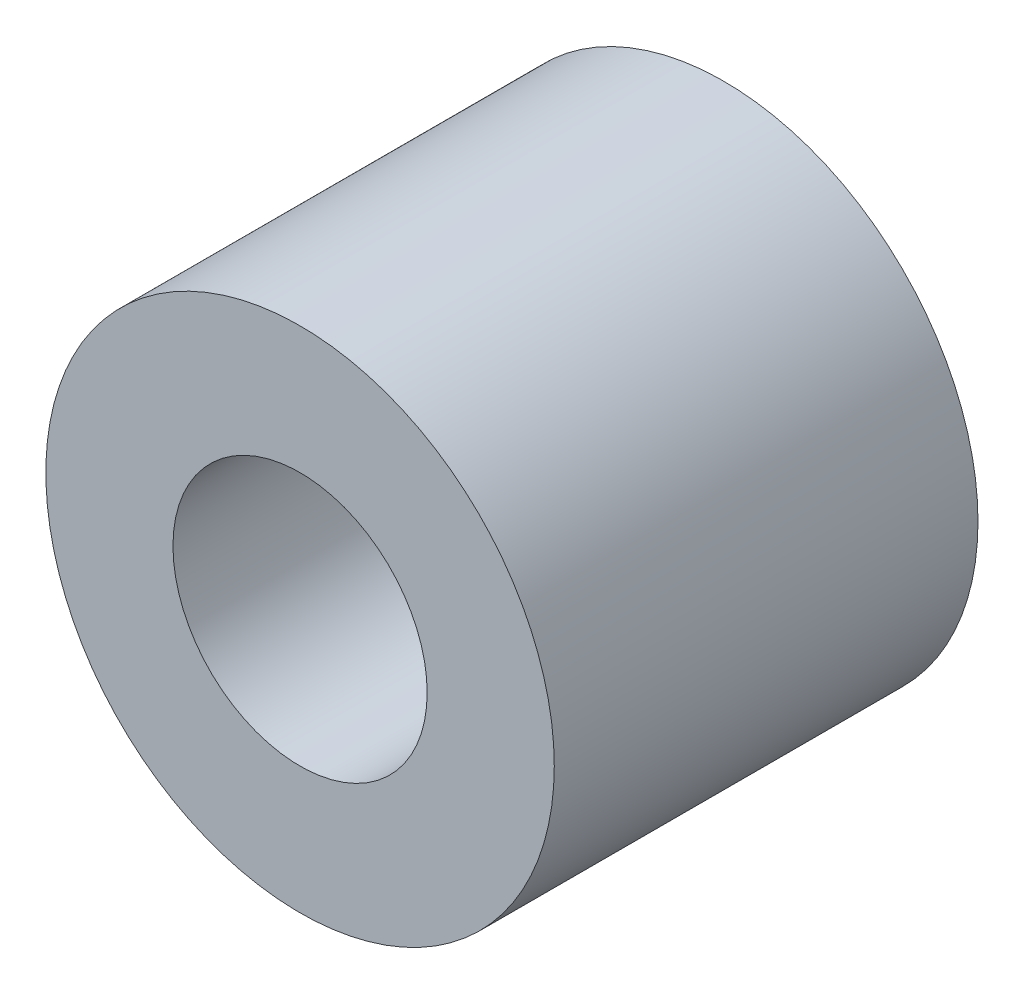
ISO-10303-21;
HEADER;
FILE_DESCRIPTION(('STEP AP214'),'2;1');
FILE_NAME('part.step','',(''),(''),'','','');
FILE_SCHEMA(('AUTOMOTIVE_DESIGN { 1 0 10303 214 1 1 1 1 }'));
ENDSEC;
DATA;
#1=APPLICATION_CONTEXT('core data for automotive mechanical design processes');
#2=APPLICATION_PROTOCOL_DEFINITION('international standard','automotive_design',2000,#1);
#3=PRODUCT_CONTEXT('',#1,'mechanical');
#4=PRODUCT('Part','Part','',(#3));
#5=PRODUCT_RELATED_PRODUCT_CATEGORY('part','',(#4));
#6=PRODUCT_DEFINITION_FORMATION('','',#4);
#7=PRODUCT_DEFINITION_CONTEXT('part definition',#1,'design');
#8=PRODUCT_DEFINITION('design','',#6,#7);
#9=PRODUCT_DEFINITION_SHAPE('','',#8);
#10=(LENGTH_UNIT() NAMED_UNIT(*) SI_UNIT(.MILLI.,.METRE.));
#11=(NAMED_UNIT(*) PLANE_ANGLE_UNIT() SI_UNIT($,.RADIAN.));
#12=(NAMED_UNIT(*) SI_UNIT($,.STERADIAN.) SOLID_ANGLE_UNIT());
#13=UNCERTAINTY_MEASURE_WITH_UNIT(LENGTH_MEASURE(1.E-05),#10,'distance_accuracy_value','');
#14=(GEOMETRIC_REPRESENTATION_CONTEXT(3) GLOBAL_UNCERTAINTY_ASSIGNED_CONTEXT((#13)) GLOBAL_UNIT_ASSIGNED_CONTEXT((#10,
#11,#12)) REPRESENTATION_CONTEXT('',''));
#15=CARTESIAN_POINT('',(0.,0.,0.));
#16=DIRECTION('',(0.,0.,1.));
#17=DIRECTION('',(1.,0.,0.));
#18=AXIS2_PLACEMENT_3D('',#15,#16,#17);
#19=CARTESIAN_POINT('',(0.,0.,25.));
#20=DIRECTION('',(0.,0.,1.));
#21=DIRECTION('',(1.,0.,0.));
#22=AXIS2_PLACEMENT_3D('',#19,#20,#21);
#23=PLANE('',#22);
#24=CARTESIAN_POINT('',(0.,0.,25.));
#25=DIRECTION('',(0.,0.,1.));
#26=DIRECTION('',(1.,0.,0.));
#27=AXIS2_PLACEMENT_3D('',#24,#25,#26);
#28=CIRCLE('',#27,30.);
#29=CARTESIAN_POINT('',(30.,0.,25.));
#30=VERTEX_POINT('',#29);
#31=EDGE_CURVE('E10',#30,#30,#28,.T.);
#32=ORIENTED_EDGE('',*,*,#31,.T.);
#33=EDGE_LOOP('',(#32));
#34=FACE_BOUND('',#33,.T.);
#35=CARTESIAN_POINT('',(0.,0.,25.));
#36=DIRECTION('',(0.,0.,1.));
#37=DIRECTION('',(1.,0.,0.));
#38=AXIS2_PLACEMENT_3D('',#35,#36,#37);
#39=CIRCLE('',#38,15.);
#40=CARTESIAN_POINT('',(15.,0.,25.));
#41=VERTEX_POINT('',#40);
#42=EDGE_CURVE('E41',#41,#41,#39,.T.);
#43=ORIENTED_EDGE('',*,*,#42,.F.);
#44=EDGE_LOOP('',(#43));
#45=FACE_BOUND('',#44,.T.);
#46=ADVANCED_FACE('F30',(#34,#45),#23,.T.);
#47=CARTESIAN_POINT('',(0.,0.,-25.));
#48=DIRECTION('',(0.,0.,1.));
#49=DIRECTION('',(1.,0.,0.));
#50=AXIS2_PLACEMENT_3D('',#47,#48,#49);
#51=PLANE('',#50);
#52=CARTESIAN_POINT('',(0.,0.,-25.));
#53=DIRECTION('',(0.,0.,1.));
#54=DIRECTION('',(1.,0.,0.));
#55=AXIS2_PLACEMENT_3D('',#52,#53,#54);
#56=CIRCLE('',#55,30.);
#57=CARTESIAN_POINT('',(30.,0.,-25.));
#58=VERTEX_POINT('',#57);
#59=EDGE_CURVE('E34',#58,#58,#56,.T.);
#60=ORIENTED_EDGE('',*,*,#59,.F.);
#61=EDGE_LOOP('',(#60));
#62=FACE_BOUND('',#61,.T.);
#63=CARTESIAN_POINT('',(0.,0.,-25.));
#64=DIRECTION('',(0.,0.,1.));
#65=DIRECTION('',(1.,0.,0.));
#66=AXIS2_PLACEMENT_3D('',#63,#64,#65);
#67=CIRCLE('',#66,15.);
#68=CARTESIAN_POINT('',(15.,0.,-25.));
#69=VERTEX_POINT('',#68);
#70=EDGE_CURVE('E43',#69,#69,#67,.T.);
#71=ORIENTED_EDGE('',*,*,#70,.T.);
#72=EDGE_LOOP('',(#71));
#73=FACE_BOUND('',#72,.T.);
#74=ADVANCED_FACE('F53',(#62,#73),#51,.F.);
#75=CARTESIAN_POINT('',(0.,0.,25.));
#76=DIRECTION('',(0.,0.,-1.));
#77=DIRECTION('',(-1.,0.,0.));
#78=AXIS2_PLACEMENT_3D('',#75,#76,#77);
#79=CYLINDRICAL_SURFACE('',#78,30.);
#80=ORIENTED_EDGE('',*,*,#31,.F.);
#81=EDGE_LOOP('',(#80));
#82=FACE_BOUND('',#81,.T.);
#83=ORIENTED_EDGE('',*,*,#59,.T.);
#84=EDGE_LOOP('',(#83));
#85=FACE_BOUND('',#84,.T.);
#86=ADVANCED_FACE('F32',(#82,#85),#79,.T.);
#87=CARTESIAN_POINT('',(0.,0.,25.));
#88=DIRECTION('',(0.,0.,-1.));
#89=DIRECTION('',(-1.,0.,0.));
#90=AXIS2_PLACEMENT_3D('',#87,#88,#89);
#91=CYLINDRICAL_SURFACE('',#90,15.);
#92=ORIENTED_EDGE('',*,*,#42,.T.);
#93=EDGE_LOOP('',(#92));
#94=FACE_BOUND('',#93,.T.);
#95=ORIENTED_EDGE('',*,*,#70,.F.);
#96=EDGE_LOOP('',(#95));
#97=FACE_BOUND('',#96,.T.);
#98=ADVANCED_FACE('F49',(#94,#97),#91,.F.);
#99=CLOSED_SHELL('',(#46,#74,#86,#98));
#100=MANIFOLD_SOLID_BREP('B2',#99);
#101=ADVANCED_BREP_SHAPE_REPRESENTATION('',(#18,#100),#14);
#102=SHAPE_DEFINITION_REPRESENTATION(#9,#101);
ENDSEC;
END-ISO-10303-21;
